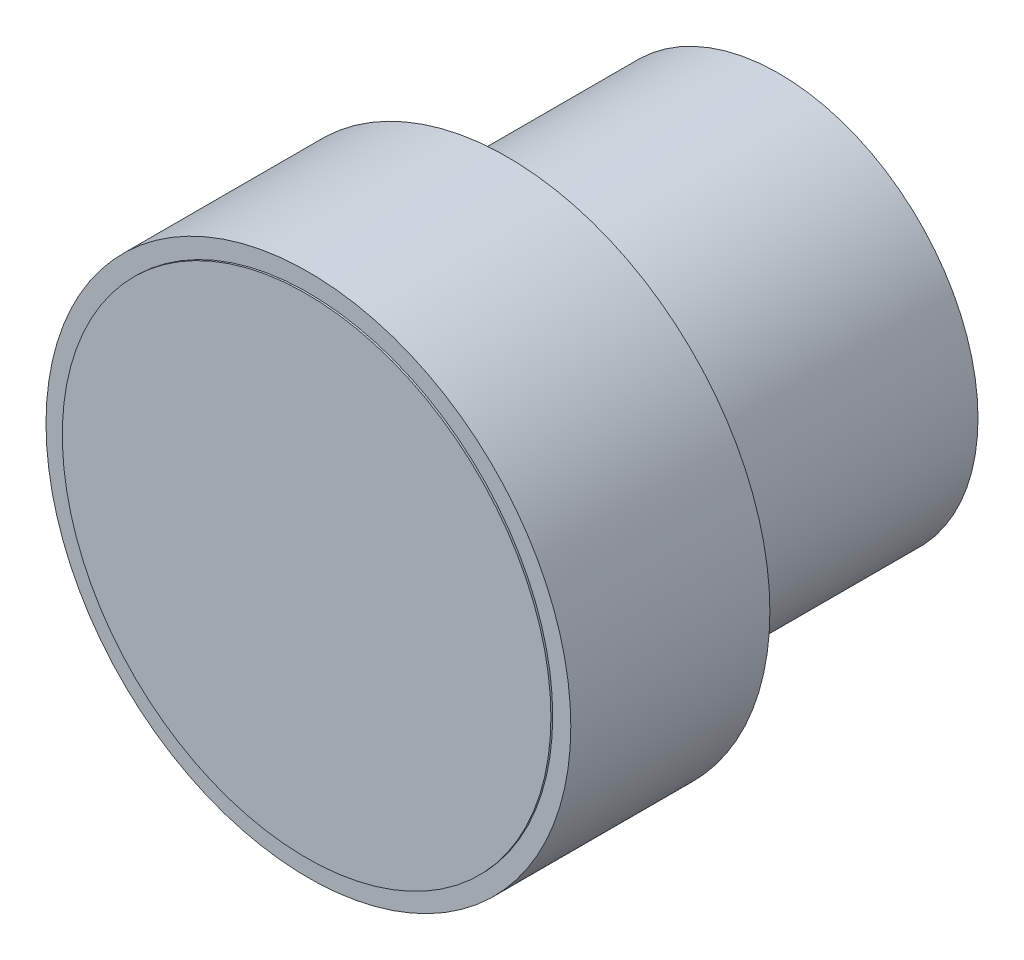
ISO-10303-21;
HEADER;
FILE_DESCRIPTION(('STEP AP214'),'2;1');
FILE_NAME('part.step','',(''),(''),'','','');
FILE_SCHEMA(('AUTOMOTIVE_DESIGN { 1 0 10303 214 1 1 1 1 }'));
ENDSEC;
DATA;
#1=APPLICATION_CONTEXT('core data for automotive mechanical design processes');
#2=APPLICATION_PROTOCOL_DEFINITION('international standard','automotive_design',2000,#1);
#3=PRODUCT_CONTEXT('',#1,'mechanical');
#4=PRODUCT('Part','Part','',(#3));
#5=PRODUCT_RELATED_PRODUCT_CATEGORY('part','',(#4));
#6=PRODUCT_DEFINITION_FORMATION('','',#4);
#7=PRODUCT_DEFINITION_CONTEXT('part definition',#1,'design');
#8=PRODUCT_DEFINITION('design','',#6,#7);
#9=PRODUCT_DEFINITION_SHAPE('','',#8);
#10=(LENGTH_UNIT() NAMED_UNIT(*) SI_UNIT(.MILLI.,.METRE.));
#11=(NAMED_UNIT(*) PLANE_ANGLE_UNIT() SI_UNIT($,.RADIAN.));
#12=(NAMED_UNIT(*) SI_UNIT($,.STERADIAN.) SOLID_ANGLE_UNIT());
#13=UNCERTAINTY_MEASURE_WITH_UNIT(LENGTH_MEASURE(1.E-05),#10,'distance_accuracy_value','');
#14=(GEOMETRIC_REPRESENTATION_CONTEXT(3) GLOBAL_UNCERTAINTY_ASSIGNED_CONTEXT((#13)) GLOBAL_UNIT_ASSIGNED_CONTEXT((#10,
#11,#12)) REPRESENTATION_CONTEXT('',''));
#15=CARTESIAN_POINT('',(0.,0.,0.));
#16=DIRECTION('',(0.,0.,1.));
#17=DIRECTION('',(1.,0.,0.));
#18=AXIS2_PLACEMENT_3D('',#15,#16,#17);
#19=CARTESIAN_POINT('',(0.,0.,15.));
#20=DIRECTION('',(0.,0.,-1.));
#21=DIRECTION('',(-1.,0.,0.));
#22=AXIS2_PLACEMENT_3D('',#19,#20,#21);
#23=CYLINDRICAL_SURFACE('',#22,11.);
#24=CARTESIAN_POINT('',(0.,0.,15.));
#25=DIRECTION('',(0.,0.,1.));
#26=DIRECTION('',(1.,0.,0.));
#27=AXIS2_PLACEMENT_3D('',#24,#25,#26);
#28=CIRCLE('',#27,11.);
#29=CARTESIAN_POINT('',(11.,0.,15.));
#30=VERTEX_POINT('',#29);
#31=EDGE_CURVE('E42',#30,#30,#28,.T.);
#32=ORIENTED_EDGE('',*,*,#31,.F.);
#33=EDGE_LOOP('',(#32));
#34=FACE_BOUND('',#33,.T.);
#35=CARTESIAN_POINT('',(0.,0.,0.));
#36=DIRECTION('',(0.,0.,1.));
#37=DIRECTION('',(1.,0.,0.));
#38=AXIS2_PLACEMENT_3D('',#35,#36,#37);
#39=CIRCLE('',#38,11.);
#40=CARTESIAN_POINT('',(11.,0.,0.));
#41=VERTEX_POINT('',#40);
#42=EDGE_CURVE('E38',#41,#41,#39,.T.);
#43=ORIENTED_EDGE('',*,*,#42,.T.);
#44=EDGE_LOOP('',(#43));
#45=FACE_BOUND('',#44,.T.);
#46=ADVANCED_FACE('F35',(#34,#45),#23,.T.);
#47=CARTESIAN_POINT('',(0.,0.,0.));
#48=DIRECTION('',(0.,0.,1.));
#49=DIRECTION('',(1.,0.,0.));
#50=AXIS2_PLACEMENT_3D('',#47,#48,#49);
#51=PLANE('',#50);
#52=ORIENTED_EDGE('',*,*,#42,.F.);
#53=EDGE_LOOP('',(#52));
#54=FACE_BOUND('',#53,.T.);
#55=ADVANCED_FACE('F76',(#54),#51,.F.);
#56=CARTESIAN_POINT('',(0.,0.,26.));
#57=DIRECTION('',(0.,0.,-1.));
#58=DIRECTION('',(-1.,0.,0.));
#59=AXIS2_PLACEMENT_3D('',#56,#57,#58);
#60=CYLINDRICAL_SURFACE('',#59,14.5);
#61=CARTESIAN_POINT('',(0.,0.,26.));
#62=DIRECTION('',(0.,0.,1.));
#63=DIRECTION('',(1.,0.,0.));
#64=AXIS2_PLACEMENT_3D('',#61,#62,#63);
#65=CIRCLE('',#64,14.5);
#66=CARTESIAN_POINT('',(14.5,0.,26.));
#67=VERTEX_POINT('',#66);
#68=EDGE_CURVE('E50',#67,#67,#65,.T.);
#69=ORIENTED_EDGE('',*,*,#68,.F.);
#70=EDGE_LOOP('',(#69));
#71=FACE_BOUND('',#70,.T.);
#72=CARTESIAN_POINT('',(0.,0.,15.));
#73=DIRECTION('',(0.,0.,1.));
#74=DIRECTION('',(1.,0.,0.));
#75=AXIS2_PLACEMENT_3D('',#72,#73,#74);
#76=CIRCLE('',#75,14.5);
#77=CARTESIAN_POINT('',(14.5,0.,15.));
#78=VERTEX_POINT('',#77);
#79=EDGE_CURVE('E53',#78,#78,#76,.T.);
#80=ORIENTED_EDGE('',*,*,#79,.T.);
#81=EDGE_LOOP('',(#80));
#82=FACE_BOUND('',#81,.T.);
#83=ADVANCED_FACE('F81',(#71,#82),#60,.T.);
#84=CARTESIAN_POINT('',(0.,0.,26.));
#85=DIRECTION('',(0.,0.,1.));
#86=DIRECTION('',(1.,0.,0.));
#87=AXIS2_PLACEMENT_3D('',#84,#85,#86);
#88=PLANE('',#87);
#89=CARTESIAN_POINT('',(0.,0.,26.));
#90=DIRECTION('',(0.,0.,1.));
#91=DIRECTION('',(1.,0.,0.));
#92=AXIS2_PLACEMENT_3D('',#89,#90,#91);
#93=CIRCLE('',#92,13.5);
#94=CARTESIAN_POINT('',(13.5,0.,26.));
#95=VERTEX_POINT('',#94);
#96=EDGE_CURVE('E10',#95,#95,#93,.T.);
#97=ORIENTED_EDGE('',*,*,#96,.F.);
#98=EDGE_LOOP('',(#97));
#99=FACE_BOUND('',#98,.T.);
#100=ORIENTED_EDGE('',*,*,#68,.T.);
#101=EDGE_LOOP('',(#100));
#102=FACE_BOUND('',#101,.T.);
#103=ADVANCED_FACE('F71',(#99,#102),#88,.T.);
#104=CARTESIAN_POINT('',(0.,0.,15.));
#105=DIRECTION('',(0.,0.,1.));
#106=DIRECTION('',(1.,0.,0.));
#107=AXIS2_PLACEMENT_3D('',#104,#105,#106);
#108=PLANE('',#107);
#109=ORIENTED_EDGE('',*,*,#31,.T.);
#110=EDGE_LOOP('',(#109));
#111=FACE_BOUND('',#110,.T.);
#112=ORIENTED_EDGE('',*,*,#79,.F.);
#113=EDGE_LOOP('',(#112));
#114=FACE_BOUND('',#113,.T.);
#115=ADVANCED_FACE('F64',(#111,#114),#108,.F.);
#116=CARTESIAN_POINT('',(0.,0.,26.1));
#117=DIRECTION('',(0.,0.,-1.));
#118=DIRECTION('',(-1.,0.,0.));
#119=AXIS2_PLACEMENT_3D('',#116,#117,#118);
#120=CYLINDRICAL_SURFACE('',#119,13.5);
#121=CARTESIAN_POINT('',(0.,0.,26.1));
#122=DIRECTION('',(0.,0.,1.));
#123=DIRECTION('',(1.,0.,0.));
#124=AXIS2_PLACEMENT_3D('',#121,#122,#123);
#125=CIRCLE('',#124,13.5);
#126=CARTESIAN_POINT('',(13.5,0.,26.1));
#127=VERTEX_POINT('',#126);
#128=EDGE_CURVE('E49',#127,#127,#125,.T.);
#129=ORIENTED_EDGE('',*,*,#128,.F.);
#130=EDGE_LOOP('',(#129));
#131=FACE_BOUND('',#130,.T.);
#132=ORIENTED_EDGE('',*,*,#96,.T.);
#133=EDGE_LOOP('',(#132));
#134=FACE_BOUND('',#133,.T.);
#135=ADVANCED_FACE('F62',(#131,#134),#120,.T.);
#136=CARTESIAN_POINT('',(0.,0.,26.1));
#137=DIRECTION('',(0.,0.,1.));
#138=DIRECTION('',(1.,0.,0.));
#139=AXIS2_PLACEMENT_3D('',#136,#137,#138);
#140=PLANE('',#139);
#141=ORIENTED_EDGE('',*,*,#128,.T.);
#142=EDGE_LOOP('',(#141));
#143=FACE_BOUND('',#142,.T.);
#144=ADVANCED_FACE('F60',(#143),#140,.T.);
#145=CLOSED_SHELL('',(#46,#55,#83,#103,#115,#135,#144));
#146=MANIFOLD_SOLID_BREP('B2',#145);
#147=ADVANCED_BREP_SHAPE_REPRESENTATION('',(#18,#146),#14);
#148=SHAPE_DEFINITION_REPRESENTATION(#9,#147);
ENDSEC;
END-ISO-10303-21;
